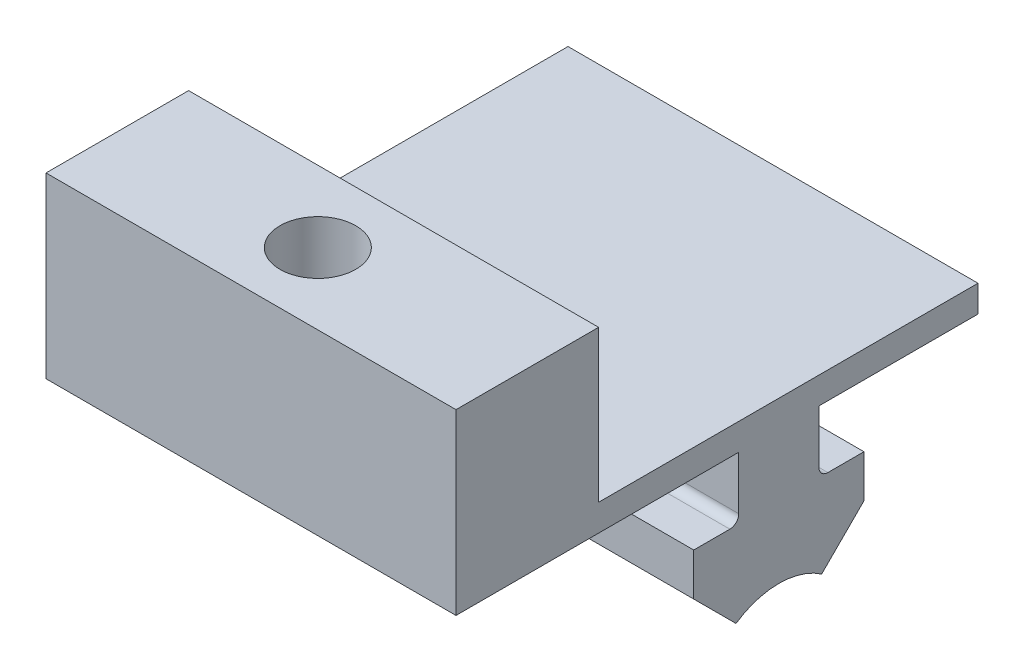
ISO-10303-21;
HEADER;
FILE_DESCRIPTION(('STEP AP214'),'2;1');
FILE_NAME('part.step','',(''),(''),'','','');
FILE_SCHEMA(('AUTOMOTIVE_DESIGN { 1 0 10303 214 1 1 1 1 }'));
ENDSEC;
DATA;
#1=APPLICATION_CONTEXT('core data for automotive mechanical design processes');
#2=APPLICATION_PROTOCOL_DEFINITION('international standard','automotive_design',2000,#1);
#3=PRODUCT_CONTEXT('',#1,'mechanical');
#4=PRODUCT('Part','Part','',(#3));
#5=PRODUCT_RELATED_PRODUCT_CATEGORY('part','',(#4));
#6=PRODUCT_DEFINITION_FORMATION('','',#4);
#7=PRODUCT_DEFINITION_CONTEXT('part definition',#1,'design');
#8=PRODUCT_DEFINITION('design','',#6,#7);
#9=PRODUCT_DEFINITION_SHAPE('','',#8);
#10=(LENGTH_UNIT() NAMED_UNIT(*) SI_UNIT(.MILLI.,.METRE.));
#11=(NAMED_UNIT(*) PLANE_ANGLE_UNIT() SI_UNIT($,.RADIAN.));
#12=(NAMED_UNIT(*) SI_UNIT($,.STERADIAN.) SOLID_ANGLE_UNIT());
#13=UNCERTAINTY_MEASURE_WITH_UNIT(LENGTH_MEASURE(1.E-05),#10,'distance_accuracy_value','');
#14=(GEOMETRIC_REPRESENTATION_CONTEXT(3) GLOBAL_UNCERTAINTY_ASSIGNED_CONTEXT((#13)) GLOBAL_UNIT_ASSIGNED_CONTEXT((#10,
#11,#12)) REPRESENTATION_CONTEXT('',''));
#15=CARTESIAN_POINT('',(0.,0.,0.));
#16=DIRECTION('',(0.,0.,1.));
#17=DIRECTION('',(1.,0.,0.));
#18=AXIS2_PLACEMENT_3D('',#15,#16,#17);
#19=CARTESIAN_POINT('',(586.099999999999,-586.100000000001,-246.077000521135));
#20=DIRECTION('',(0.,0.,1.));
#21=DIRECTION('',(1.,0.,0.));
#22=AXIS2_PLACEMENT_3D('',#19,#20,#21);
#23=PLANE('',#22);
#24=DIRECTION('',(0.,-1.,0.));
#25=VECTOR('',#24,1.);
#26=CARTESIAN_POINT('',(632.099999999999,-586.100000000001,-246.077000521135));
#27=LINE('',#26,#25);
#28=CARTESIAN_POINT('',(632.099999999999,-566.100000000001,-246.077000521135));
#29=VERTEX_POINT('',#28);
#30=CARTESIAN_POINT('',(632.099999999999,-586.100000000001,-246.077000521135));
#31=VERTEX_POINT('',#30);
#32=EDGE_CURVE('E193',#29,#31,#27,.T.);
#33=ORIENTED_EDGE('',*,*,#32,.F.);
#34=DIRECTION('',(1.,0.,0.));
#35=VECTOR('',#34,1.);
#36=CARTESIAN_POINT('',(586.099999999999,-566.100000000001,-246.077000521135));
#37=LINE('',#36,#35);
#38=CARTESIAN_POINT('',(586.099999999999,-566.100000000001,-246.077000521135));
#39=VERTEX_POINT('',#38);
#40=EDGE_CURVE('E11',#39,#29,#37,.T.);
#41=ORIENTED_EDGE('',*,*,#40,.F.);
#42=DIRECTION('',(0.,-1.,0.));
#43=VECTOR('',#42,1.);
#44=CARTESIAN_POINT('',(586.099999999999,-586.100000000001,-246.077000521135));
#45=LINE('',#44,#43);
#46=CARTESIAN_POINT('',(586.099999999999,-586.100000000001,-246.077000521135));
#47=VERTEX_POINT('',#46);
#48=EDGE_CURVE('E244',#39,#47,#45,.T.);
#49=ORIENTED_EDGE('',*,*,#48,.T.);
#50=DIRECTION('',(1.,0.,0.));
#51=VECTOR('',#50,1.);
#52=CARTESIAN_POINT('',(586.099999999999,-586.100000000001,-246.077000521135));
#53=LINE('',#52,#51);
#54=EDGE_CURVE('E39',#47,#31,#53,.T.);
#55=ORIENTED_EDGE('',*,*,#54,.T.);
#56=EDGE_LOOP('',(#33,#41,#49,#55));
#57=FACE_BOUND('',#56,.T.);
#58=ADVANCED_FACE('F36',(#57),#23,.T.);
#59=CARTESIAN_POINT('',(586.099999999999,-566.100000000001,-246.077000521135));
#60=DIRECTION('',(0.,1.,0.));
#61=DIRECTION('',(-1.,0.,0.));
#62=AXIS2_PLACEMENT_3D('',#59,#60,#61);
#63=PLANE('',#62);
#64=CARTESIAN_POINT('',(608.598456538136,-566.100000000001,-254.077000521131));
#65=DIRECTION('',(0.,1.,0.));
#66=DIRECTION('',(-1.,0.,0.));
#67=AXIS2_PLACEMENT_3D('',#64,#65,#66);
#68=CIRCLE('',#67,4.25000000000001);
#69=CARTESIAN_POINT('',(604.348456538136,-566.100000000001,-254.077000521131));
#70=VERTEX_POINT('',#69);
#71=EDGE_CURVE('E362',#70,#70,#68,.T.);
#72=ORIENTED_EDGE('',*,*,#71,.F.);
#73=EDGE_LOOP('',(#72));
#74=FACE_BOUND('',#73,.T.);
#75=DIRECTION('',(0.,0.,1.));
#76=VECTOR('',#75,1.);
#77=CARTESIAN_POINT('',(632.099999999999,-566.100000000001,-246.077000521135));
#78=LINE('',#77,#76);
#79=CARTESIAN_POINT('',(632.099999999999,-566.100000000001,-262.077000521136));
#80=VERTEX_POINT('',#79);
#81=EDGE_CURVE('E242',#80,#29,#78,.T.);
#82=ORIENTED_EDGE('',*,*,#81,.F.);
#83=DIRECTION('',(1.,0.,0.));
#84=VECTOR('',#83,1.);
#85=CARTESIAN_POINT('',(586.099999999999,-566.100000000001,-262.077000521136));
#86=LINE('',#85,#84);
#87=CARTESIAN_POINT('',(586.099999999999,-566.100000000001,-262.077000521136));
#88=VERTEX_POINT('',#87);
#89=EDGE_CURVE('E45',#88,#80,#86,.T.);
#90=ORIENTED_EDGE('',*,*,#89,.F.);
#91=DIRECTION('',(0.,0.,1.));
#92=VECTOR('',#91,1.);
#93=CARTESIAN_POINT('',(586.099999999999,-566.100000000001,-246.077000521135));
#94=LINE('',#93,#92);
#95=EDGE_CURVE('E183',#88,#39,#94,.T.);
#96=ORIENTED_EDGE('',*,*,#95,.T.);
#97=ORIENTED_EDGE('',*,*,#40,.T.);
#98=EDGE_LOOP('',(#82,#90,#96,#97));
#99=FACE_BOUND('',#98,.T.);
#100=ADVANCED_FACE('F277',(#74,#99),#63,.T.);
#101=CARTESIAN_POINT('',(586.099999999999,-566.100000000001,-262.077000521136));
#102=DIRECTION('',(0.,0.,-1.));
#103=DIRECTION('',(0.,1.,0.));
#104=AXIS2_PLACEMENT_3D('',#101,#102,#103);
#105=PLANE('',#104);
#106=DIRECTION('',(0.,1.,0.));
#107=VECTOR('',#106,1.);
#108=CARTESIAN_POINT('',(632.099999999999,-566.100000000001,-262.077000521136));
#109=LINE('',#108,#107);
#110=CARTESIAN_POINT('',(632.099999999999,-583.100000000001,-262.077000521136));
#111=VERTEX_POINT('',#110);
#112=EDGE_CURVE('E170',#111,#80,#109,.T.);
#113=ORIENTED_EDGE('',*,*,#112,.F.);
#114=DIRECTION('',(1.,0.,0.));
#115=VECTOR('',#114,1.);
#116=CARTESIAN_POINT('',(586.099999999999,-583.100000000001,-262.077000521136));
#117=LINE('',#116,#115);
#118=CARTESIAN_POINT('',(586.099999999999,-583.100000000001,-262.077000521136));
#119=VERTEX_POINT('',#118);
#120=EDGE_CURVE('E165',#119,#111,#117,.T.);
#121=ORIENTED_EDGE('',*,*,#120,.F.);
#122=DIRECTION('',(0.,1.,0.));
#123=VECTOR('',#122,1.);
#124=CARTESIAN_POINT('',(586.099999999999,-566.100000000001,-262.077000521136));
#125=LINE('',#124,#123);
#126=EDGE_CURVE('E168',#119,#88,#125,.T.);
#127=ORIENTED_EDGE('',*,*,#126,.T.);
#128=ORIENTED_EDGE('',*,*,#89,.T.);
#129=EDGE_LOOP('',(#113,#121,#127,#128));
#130=FACE_BOUND('',#129,.T.);
#131=ADVANCED_FACE('F167',(#130),#105,.T.);
#132=CARTESIAN_POINT('',(586.099999999999,-583.100000000001,-262.077000521136));
#133=DIRECTION('',(0.,1.,0.));
#134=DIRECTION('',(0.,0.,1.));
#135=AXIS2_PLACEMENT_3D('',#132,#133,#134);
#136=PLANE('',#135);
#137=DIRECTION('',(0.,0.,1.));
#138=VECTOR('',#137,1.);
#139=CARTESIAN_POINT('',(632.099999999999,-583.100000000001,-262.077000521136));
#140=LINE('',#139,#138);
#141=CARTESIAN_POINT('',(632.099999999999,-583.100000000001,-304.643123208106));
#142=VERTEX_POINT('',#141);
#143=EDGE_CURVE('E239',#142,#111,#140,.T.);
#144=ORIENTED_EDGE('',*,*,#143,.F.);
#145=DIRECTION('',(1.,0.,0.));
#146=VECTOR('',#145,1.);
#147=CARTESIAN_POINT('',(586.099999999999,-583.100000000001,-304.643123208106));
#148=LINE('',#147,#146);
#149=CARTESIAN_POINT('',(586.099999999999,-583.100000000001,-304.643123208106));
#150=VERTEX_POINT('',#149);
#151=EDGE_CURVE('E175',#150,#142,#148,.T.);
#152=ORIENTED_EDGE('',*,*,#151,.F.);
#153=DIRECTION('',(0.,0.,1.));
#154=VECTOR('',#153,1.);
#155=CARTESIAN_POINT('',(586.099999999999,-583.100000000001,-262.077000521136));
#156=LINE('',#155,#154);
#157=EDGE_CURVE('E181',#150,#119,#156,.T.);
#158=ORIENTED_EDGE('',*,*,#157,.T.);
#159=ORIENTED_EDGE('',*,*,#120,.T.);
#160=EDGE_LOOP('',(#144,#152,#158,#159));
#161=FACE_BOUND('',#160,.T.);
#162=ADVANCED_FACE('F185',(#161),#136,.T.);
#163=CARTESIAN_POINT('',(586.099999999999,-583.100000000001,-304.643123208106));
#164=DIRECTION('',(0.,0.,-1.));
#165=DIRECTION('',(-1.,0.,0.));
#166=AXIS2_PLACEMENT_3D('',#163,#164,#165);
#167=PLANE('',#166);
#168=DIRECTION('',(0.,1.,0.));
#169=VECTOR('',#168,1.);
#170=CARTESIAN_POINT('',(632.099999999999,-583.100000000001,-304.643123208106));
#171=LINE('',#170,#169);
#172=CARTESIAN_POINT('',(632.099999999999,-586.100000000001,-304.643123208106));
#173=VERTEX_POINT('',#172);
#174=EDGE_CURVE('E236',#173,#142,#171,.T.);
#175=ORIENTED_EDGE('',*,*,#174,.F.);
#176=DIRECTION('',(1.,0.,0.));
#177=VECTOR('',#176,1.);
#178=CARTESIAN_POINT('',(586.099999999999,-586.100000000001,-304.643123208106));
#179=LINE('',#178,#177);
#180=CARTESIAN_POINT('',(586.099999999999,-586.100000000001,-304.643123208106));
#181=VERTEX_POINT('',#180);
#182=EDGE_CURVE('E248',#181,#173,#179,.T.);
#183=ORIENTED_EDGE('',*,*,#182,.F.);
#184=DIRECTION('',(0.,1.,0.));
#185=VECTOR('',#184,1.);
#186=CARTESIAN_POINT('',(586.099999999999,-583.100000000001,-304.643123208106));
#187=LINE('',#186,#185);
#188=EDGE_CURVE('E186',#181,#150,#187,.T.);
#189=ORIENTED_EDGE('',*,*,#188,.T.);
#190=ORIENTED_EDGE('',*,*,#151,.T.);
#191=EDGE_LOOP('',(#175,#183,#189,#190));
#192=FACE_BOUND('',#191,.T.);
#193=ADVANCED_FACE('F292',(#192),#167,.T.);
#194=CARTESIAN_POINT('',(586.099999999999,-586.100000000001,-304.643123208106));
#195=DIRECTION('',(0.,-1.,0.));
#196=DIRECTION('',(0.,0.,-1.));
#197=AXIS2_PLACEMENT_3D('',#194,#195,#196);
#198=PLANE('',#197);
#199=DIRECTION('',(0.,0.,-1.));
#200=VECTOR('',#199,1.);
#201=CARTESIAN_POINT('',(632.099999999999,-586.100000000001,-304.643123208106));
#202=LINE('',#201,#200);
#203=CARTESIAN_POINT('',(632.099999999999,-586.100000000001,-286.8));
#204=VERTEX_POINT('',#203);
#205=EDGE_CURVE('E233',#204,#173,#202,.T.);
#206=ORIENTED_EDGE('',*,*,#205,.F.);
#207=DIRECTION('',(1.,0.,0.));
#208=VECTOR('',#207,1.);
#209=CARTESIAN_POINT('',(586.099999999999,-586.100000000001,-286.8));
#210=LINE('',#209,#208);
#211=CARTESIAN_POINT('',(586.099999999999,-586.100000000001,-286.8));
#212=VERTEX_POINT('',#211);
#213=EDGE_CURVE('E250',#212,#204,#210,.T.);
#214=ORIENTED_EDGE('',*,*,#213,.F.);
#215=DIRECTION('',(0.,0.,-1.));
#216=VECTOR('',#215,1.);
#217=CARTESIAN_POINT('',(586.099999999999,-586.100000000001,-304.643123208106));
#218=LINE('',#217,#216);
#219=EDGE_CURVE('E188',#212,#181,#218,.T.);
#220=ORIENTED_EDGE('',*,*,#219,.T.);
#221=ORIENTED_EDGE('',*,*,#182,.T.);
#222=EDGE_LOOP('',(#206,#214,#220,#221));
#223=FACE_BOUND('',#222,.T.);
#224=ADVANCED_FACE('F295',(#223),#198,.T.);
#225=CARTESIAN_POINT('',(586.099999999999,-586.100000000001,-286.8));
#226=DIRECTION('',(0.,0.,-1.));
#227=DIRECTION('',(0.,1.,0.));
#228=AXIS2_PLACEMENT_3D('',#225,#226,#227);
#229=PLANE('',#228);
#230=DIRECTION('',(0.,1.,0.));
#231=VECTOR('',#230,1.);
#232=CARTESIAN_POINT('',(632.099999999999,-586.100000000001,-286.8));
#233=LINE('',#232,#231);
#234=CARTESIAN_POINT('',(632.099999999999,-592.075000000001,-286.8));
#235=VERTEX_POINT('',#234);
#236=EDGE_CURVE('E230',#235,#204,#233,.T.);
#237=ORIENTED_EDGE('',*,*,#236,.F.);
#238=DIRECTION('',(1.,0.,0.));
#239=VECTOR('',#238,1.);
#240=CARTESIAN_POINT('',(586.099999999999,-592.075000000001,-286.8));
#241=LINE('',#240,#239);
#242=CARTESIAN_POINT('',(586.099999999999,-592.075000000001,-286.8));
#243=VERTEX_POINT('',#242);
#244=EDGE_CURVE('E252',#243,#235,#241,.T.);
#245=ORIENTED_EDGE('',*,*,#244,.F.);
#246=DIRECTION('',(0.,1.,0.));
#247=VECTOR('',#246,1.);
#248=CARTESIAN_POINT('',(586.099999999999,-592.075000000001,-286.8));
#249=LINE('',#248,#247);
#250=EDGE_CURVE('E399',#243,#212,#249,.T.);
#251=ORIENTED_EDGE('',*,*,#250,.T.);
#252=ORIENTED_EDGE('',*,*,#213,.T.);
#253=EDGE_LOOP('',(#237,#245,#251,#252));
#254=FACE_BOUND('',#253,.T.);
#255=ADVANCED_FACE('F299',(#254),#229,.T.);
#256=CARTESIAN_POINT('',(586.099999999999,-592.075000000001,-287.8));
#257=DIRECTION('',(1.,0.,0.));
#258=DIRECTION('',(0.,0.,-1.));
#259=AXIS2_PLACEMENT_3D('',#256,#257,#258);
#260=CYLINDRICAL_SURFACE('',#259,1.);
#261=CARTESIAN_POINT('',(632.099999999999,-592.075000000001,-287.8));
#262=DIRECTION('',(-1.,0.,0.));
#263=DIRECTION('',(0.,0.,-1.));
#264=AXIS2_PLACEMENT_3D('',#261,#262,#263);
#265=CIRCLE('',#264,1.);
#266=CARTESIAN_POINT('',(632.099999999999,-593.075000000001,-287.8));
#267=VERTEX_POINT('',#266);
#268=EDGE_CURVE('E227',#267,#235,#265,.T.);
#269=ORIENTED_EDGE('',*,*,#268,.F.);
#270=DIRECTION('',(1.,0.,0.));
#271=VECTOR('',#270,1.);
#272=CARTESIAN_POINT('',(586.099999999999,-593.075000000001,-287.8));
#273=LINE('',#272,#271);
#274=CARTESIAN_POINT('',(586.099999999999,-593.075000000001,-287.8));
#275=VERTEX_POINT('',#274);
#276=EDGE_CURVE('E255',#275,#267,#273,.T.);
#277=ORIENTED_EDGE('',*,*,#276,.F.);
#278=CARTESIAN_POINT('',(586.099999999999,-592.075000000001,-287.8));
#279=DIRECTION('',(-1.,0.,0.));
#280=DIRECTION('',(0.,0.,-1.));
#281=AXIS2_PLACEMENT_3D('',#278,#279,#280);
#282=CIRCLE('',#281,1.);
#283=EDGE_CURVE('E396',#275,#243,#282,.T.);
#284=ORIENTED_EDGE('',*,*,#283,.T.);
#285=ORIENTED_EDGE('',*,*,#244,.T.);
#286=EDGE_LOOP('',(#269,#277,#284,#285));
#287=FACE_BOUND('',#286,.T.);
#288=ADVANCED_FACE('F303',(#287),#260,.F.);
#289=CARTESIAN_POINT('',(586.099999999999,-593.075000000001,-291.85));
#290=DIRECTION('',(0.,1.,0.));
#291=DIRECTION('',(-1.,0.,0.));
#292=AXIS2_PLACEMENT_3D('',#289,#290,#291);
#293=PLANE('',#292);
#294=DIRECTION('',(0.,0.,1.));
#295=VECTOR('',#294,1.);
#296=CARTESIAN_POINT('',(632.099999999999,-593.075000000001,-291.85));
#297=LINE('',#296,#295);
#298=CARTESIAN_POINT('',(632.099999999999,-593.075000000001,-291.85));
#299=VERTEX_POINT('',#298);
#300=EDGE_CURVE('E224',#299,#267,#297,.T.);
#301=ORIENTED_EDGE('',*,*,#300,.F.);
#302=DIRECTION('',(1.,0.,0.));
#303=VECTOR('',#302,1.);
#304=CARTESIAN_POINT('',(586.099999999999,-593.075000000001,-291.85));
#305=LINE('',#304,#303);
#306=CARTESIAN_POINT('',(586.099999999999,-593.075000000001,-291.85));
#307=VERTEX_POINT('',#306);
#308=EDGE_CURVE('E257',#307,#299,#305,.T.);
#309=ORIENTED_EDGE('',*,*,#308,.F.);
#310=DIRECTION('',(0.,0.,1.));
#311=VECTOR('',#310,1.);
#312=CARTESIAN_POINT('',(586.099999999999,-593.075000000001,-291.85));
#313=LINE('',#312,#311);
#314=EDGE_CURVE('E393',#307,#275,#313,.T.);
#315=ORIENTED_EDGE('',*,*,#314,.T.);
#316=ORIENTED_EDGE('',*,*,#276,.T.);
#317=EDGE_LOOP('',(#301,#309,#315,#316));
#318=FACE_BOUND('',#317,.T.);
#319=ADVANCED_FACE('F307',(#318),#293,.T.);
#320=CARTESIAN_POINT('',(586.099999999999,-597.842893218814,-291.85));
#321=DIRECTION('',(0.,0.,-1.));
#322=DIRECTION('',(-1.,0.,0.));
#323=AXIS2_PLACEMENT_3D('',#320,#321,#322);
#324=PLANE('',#323);
#325=DIRECTION('',(0.,1.,0.));
#326=VECTOR('',#325,1.);
#327=CARTESIAN_POINT('',(632.099999999999,-597.842893218814,-291.85));
#328=LINE('',#327,#326);
#329=CARTESIAN_POINT('',(632.099999999999,-597.842893218814,-291.85));
#330=VERTEX_POINT('',#329);
#331=EDGE_CURVE('E221',#330,#299,#328,.T.);
#332=ORIENTED_EDGE('',*,*,#331,.F.);
#333=DIRECTION('',(1.,0.,0.));
#334=VECTOR('',#333,1.);
#335=CARTESIAN_POINT('',(586.099999999999,-597.842893218814,-291.85));
#336=LINE('',#335,#334);
#337=CARTESIAN_POINT('',(586.099999999999,-597.842893218814,-291.85));
#338=VERTEX_POINT('',#337);
#339=EDGE_CURVE('E259',#338,#330,#336,.T.);
#340=ORIENTED_EDGE('',*,*,#339,.F.);
#341=DIRECTION('',(0.,1.,0.));
#342=VECTOR('',#341,1.);
#343=CARTESIAN_POINT('',(586.099999999999,-597.842893218814,-291.85));
#344=LINE('',#343,#342);
#345=EDGE_CURVE('E390',#338,#307,#344,.T.);
#346=ORIENTED_EDGE('',*,*,#345,.T.);
#347=ORIENTED_EDGE('',*,*,#308,.T.);
#348=EDGE_LOOP('',(#332,#340,#346,#347));
#349=FACE_BOUND('',#348,.T.);
#350=ADVANCED_FACE('F311',(#349),#324,.T.);
#351=CARTESIAN_POINT('',(586.099999999999,-602.588217609605,-287.104675609209));
#352=DIRECTION('',(0.,-0.707106781186552,-0.707106781186543));
#353=DIRECTION('',(0.,0.707106781186543,-0.707106781186552));
#354=AXIS2_PLACEMENT_3D('',#351,#352,#353);
#355=PLANE('',#354);
#356=DIRECTION('',(0.,0.707106781186543,-0.707106781186552));
#357=VECTOR('',#356,1.);
#358=CARTESIAN_POINT('',(632.099999999999,-602.588217609605,-287.104675609209));
#359=LINE('',#358,#357);
#360=CARTESIAN_POINT('',(632.099999999999,-602.588217609605,-287.104675609209));
#361=VERTEX_POINT('',#360);
#362=EDGE_CURVE('E218',#361,#330,#359,.T.);
#363=ORIENTED_EDGE('',*,*,#362,.F.);
#364=DIRECTION('',(1.,0.,0.));
#365=VECTOR('',#364,1.);
#366=CARTESIAN_POINT('',(586.099999999999,-602.588217609605,-287.104675609209));
#367=LINE('',#366,#365);
#368=CARTESIAN_POINT('',(586.099999999999,-602.588217609605,-287.104675609209));
#369=VERTEX_POINT('',#368);
#370=EDGE_CURVE('E261',#369,#361,#367,.T.);
#371=ORIENTED_EDGE('',*,*,#370,.F.);
#372=DIRECTION('',(0.,0.707106781186543,-0.707106781186552));
#373=VECTOR('',#372,1.);
#374=CARTESIAN_POINT('',(586.099999999999,-602.588217609605,-287.104675609209));
#375=LINE('',#374,#373);
#376=EDGE_CURVE('E387',#369,#338,#375,.T.);
#377=ORIENTED_EDGE('',*,*,#376,.T.);
#378=ORIENTED_EDGE('',*,*,#339,.T.);
#379=EDGE_LOOP('',(#363,#371,#377,#378));
#380=FACE_BOUND('',#379,.T.);
#381=ADVANCED_FACE('F315',(#380),#355,.T.);
#382=CARTESIAN_POINT('',(586.099999999999,-609.600000000001,-282.3));
#383=DIRECTION('',(1.,0.,0.));
#384=DIRECTION('',(0.,0.,-1.));
#385=AXIS2_PLACEMENT_3D('',#382,#383,#384);
#386=CYLINDRICAL_SURFACE('',#385,8.50000000000006);
#387=CARTESIAN_POINT('',(632.099999999999,-609.600000000001,-282.3));
#388=DIRECTION('',(-1.,0.,0.));
#389=DIRECTION('',(0.,0.,-1.));
#390=AXIS2_PLACEMENT_3D('',#387,#388,#389);
#391=CIRCLE('',#390,8.50000000000006);
#392=CARTESIAN_POINT('',(632.099999999999,-602.588217609605,-277.49532439079));
#393=VERTEX_POINT('',#392);
#394=EDGE_CURVE('E215',#393,#361,#391,.T.);
#395=ORIENTED_EDGE('',*,*,#394,.F.);
#396=DIRECTION('',(1.,0.,0.));
#397=VECTOR('',#396,1.);
#398=CARTESIAN_POINT('',(586.099999999999,-602.588217609605,-277.49532439079));
#399=LINE('',#398,#397);
#400=CARTESIAN_POINT('',(586.099999999999,-602.588217609605,-277.49532439079));
#401=VERTEX_POINT('',#400);
#402=EDGE_CURVE('E263',#401,#393,#399,.T.);
#403=ORIENTED_EDGE('',*,*,#402,.F.);
#404=CARTESIAN_POINT('',(586.099999999999,-609.600000000001,-282.3));
#405=DIRECTION('',(-1.,0.,0.));
#406=DIRECTION('',(0.,0.,-1.));
#407=AXIS2_PLACEMENT_3D('',#404,#405,#406);
#408=CIRCLE('',#407,8.50000000000006);
#409=EDGE_CURVE('E384',#401,#369,#408,.T.);
#410=ORIENTED_EDGE('',*,*,#409,.T.);
#411=ORIENTED_EDGE('',*,*,#370,.T.);
#412=EDGE_LOOP('',(#395,#403,#410,#411));
#413=FACE_BOUND('',#412,.T.);
#414=ADVANCED_FACE('F319',(#413),#386,.F.);
#415=CARTESIAN_POINT('',(586.099999999999,-597.842893218814,-272.75));
#416=DIRECTION('',(0.,-0.707106781186539,0.707106781186556));
#417=DIRECTION('',(0.,-0.707106781186556,-0.707106781186539));
#418=AXIS2_PLACEMENT_3D('',#415,#416,#417);
#419=PLANE('',#418);
#420=DIRECTION('',(0.,-0.707106781186556,-0.707106781186539));
#421=VECTOR('',#420,1.);
#422=CARTESIAN_POINT('',(632.099999999999,-597.842893218814,-272.75));
#423=LINE('',#422,#421);
#424=CARTESIAN_POINT('',(632.099999999999,-597.842893218814,-272.75));
#425=VERTEX_POINT('',#424);
#426=EDGE_CURVE('E212',#425,#393,#423,.T.);
#427=ORIENTED_EDGE('',*,*,#426,.F.);
#428=DIRECTION('',(1.,0.,0.));
#429=VECTOR('',#428,1.);
#430=CARTESIAN_POINT('',(586.099999999999,-597.842893218814,-272.75));
#431=LINE('',#430,#429);
#432=CARTESIAN_POINT('',(586.099999999999,-597.842893218814,-272.75));
#433=VERTEX_POINT('',#432);
#434=EDGE_CURVE('E265',#433,#425,#431,.T.);
#435=ORIENTED_EDGE('',*,*,#434,.F.);
#436=DIRECTION('',(0.,-0.707106781186556,-0.707106781186539));
#437=VECTOR('',#436,1.);
#438=CARTESIAN_POINT('',(586.099999999999,-597.842893218814,-272.75));
#439=LINE('',#438,#437);
#440=EDGE_CURVE('E381',#433,#401,#439,.T.);
#441=ORIENTED_EDGE('',*,*,#440,.T.);
#442=ORIENTED_EDGE('',*,*,#402,.T.);
#443=EDGE_LOOP('',(#427,#435,#441,#442));
#444=FACE_BOUND('',#443,.T.);
#445=ADVANCED_FACE('F323',(#444),#419,.T.);
#446=CARTESIAN_POINT('',(586.099999999999,-593.075000000001,-272.75));
#447=DIRECTION('',(0.,0.,1.));
#448=DIRECTION('',(0.,-1.,0.));
#449=AXIS2_PLACEMENT_3D('',#446,#447,#448);
#450=PLANE('',#449);
#451=DIRECTION('',(0.,-1.,0.));
#452=VECTOR('',#451,1.);
#453=CARTESIAN_POINT('',(632.099999999999,-593.075000000001,-272.75));
#454=LINE('',#453,#452);
#455=CARTESIAN_POINT('',(632.099999999999,-593.075000000001,-272.75));
#456=VERTEX_POINT('',#455);
#457=EDGE_CURVE('E209',#456,#425,#454,.T.);
#458=ORIENTED_EDGE('',*,*,#457,.F.);
#459=DIRECTION('',(1.,0.,0.));
#460=VECTOR('',#459,1.);
#461=CARTESIAN_POINT('',(586.099999999999,-593.075000000001,-272.75));
#462=LINE('',#461,#460);
#463=CARTESIAN_POINT('',(586.099999999999,-593.075000000001,-272.75));
#464=VERTEX_POINT('',#463);
#465=EDGE_CURVE('E267',#464,#456,#462,.T.);
#466=ORIENTED_EDGE('',*,*,#465,.F.);
#467=DIRECTION('',(0.,-1.,0.));
#468=VECTOR('',#467,1.);
#469=CARTESIAN_POINT('',(586.099999999999,-593.075000000001,-272.75));
#470=LINE('',#469,#468);
#471=EDGE_CURVE('E378',#464,#433,#470,.T.);
#472=ORIENTED_EDGE('',*,*,#471,.T.);
#473=ORIENTED_EDGE('',*,*,#434,.T.);
#474=EDGE_LOOP('',(#458,#466,#472,#473));
#475=FACE_BOUND('',#474,.T.);
#476=ADVANCED_FACE('F327',(#475),#450,.T.);
#477=CARTESIAN_POINT('',(586.099999999999,-593.075000000001,-276.8));
#478=DIRECTION('',(0.,1.,0.));
#479=DIRECTION('',(-1.,0.,0.));
#480=AXIS2_PLACEMENT_3D('',#477,#478,#479);
#481=PLANE('',#480);
#482=DIRECTION('',(0.,0.,1.));
#483=VECTOR('',#482,1.);
#484=CARTESIAN_POINT('',(632.099999999999,-593.075000000001,-276.8));
#485=LINE('',#484,#483);
#486=CARTESIAN_POINT('',(632.099999999999,-593.075000000001,-276.8));
#487=VERTEX_POINT('',#486);
#488=EDGE_CURVE('E206',#487,#456,#485,.T.);
#489=ORIENTED_EDGE('',*,*,#488,.F.);
#490=DIRECTION('',(1.,0.,0.));
#491=VECTOR('',#490,1.);
#492=CARTESIAN_POINT('',(586.099999999999,-593.075000000001,-276.8));
#493=LINE('',#492,#491);
#494=CARTESIAN_POINT('',(586.099999999999,-593.075000000001,-276.8));
#495=VERTEX_POINT('',#494);
#496=EDGE_CURVE('E269',#495,#487,#493,.T.);
#497=ORIENTED_EDGE('',*,*,#496,.F.);
#498=DIRECTION('',(0.,0.,1.));
#499=VECTOR('',#498,1.);
#500=CARTESIAN_POINT('',(586.099999999999,-593.075000000001,-276.8));
#501=LINE('',#500,#499);
#502=EDGE_CURVE('E375',#495,#464,#501,.T.);
#503=ORIENTED_EDGE('',*,*,#502,.T.);
#504=ORIENTED_EDGE('',*,*,#465,.T.);
#505=EDGE_LOOP('',(#489,#497,#503,#504));
#506=FACE_BOUND('',#505,.T.);
#507=ADVANCED_FACE('F331',(#506),#481,.T.);
#508=CARTESIAN_POINT('',(586.099999999999,-592.075000000001,-276.8));
#509=DIRECTION('',(1.,0.,0.));
#510=DIRECTION('',(0.,0.,-1.));
#511=AXIS2_PLACEMENT_3D('',#508,#509,#510);
#512=CYLINDRICAL_SURFACE('',#511,0.999999999999918);
#513=CARTESIAN_POINT('',(632.099999999999,-592.075000000001,-276.8));
#514=DIRECTION('',(-1.,0.,0.));
#515=DIRECTION('',(0.,0.,-1.));
#516=AXIS2_PLACEMENT_3D('',#513,#514,#515);
#517=CIRCLE('',#516,0.999999999999918);
#518=CARTESIAN_POINT('',(632.099999999999,-592.075000000001,-277.8));
#519=VERTEX_POINT('',#518);
#520=EDGE_CURVE('E203',#519,#487,#517,.T.);
#521=ORIENTED_EDGE('',*,*,#520,.F.);
#522=DIRECTION('',(1.,0.,0.));
#523=VECTOR('',#522,1.);
#524=CARTESIAN_POINT('',(586.099999999999,-592.075000000001,-277.8));
#525=LINE('',#524,#523);
#526=CARTESIAN_POINT('',(586.099999999999,-592.075000000001,-277.8));
#527=VERTEX_POINT('',#526);
#528=EDGE_CURVE('E271',#527,#519,#525,.T.);
#529=ORIENTED_EDGE('',*,*,#528,.F.);
#530=CARTESIAN_POINT('',(586.099999999999,-592.075000000001,-276.8));
#531=DIRECTION('',(-1.,0.,0.));
#532=DIRECTION('',(0.,0.,-1.));
#533=AXIS2_PLACEMENT_3D('',#530,#531,#532);
#534=CIRCLE('',#533,0.999999999999918);
#535=EDGE_CURVE('E372',#527,#495,#534,.T.);
#536=ORIENTED_EDGE('',*,*,#535,.T.);
#537=ORIENTED_EDGE('',*,*,#496,.T.);
#538=EDGE_LOOP('',(#521,#529,#536,#537));
#539=FACE_BOUND('',#538,.T.);
#540=ADVANCED_FACE('F335',(#539),#512,.F.);
#541=CARTESIAN_POINT('',(586.099999999999,-589.100000000001,-277.8));
#542=DIRECTION('',(0.,0.,1.));
#543=DIRECTION('',(0.,-1.,0.));
#544=AXIS2_PLACEMENT_3D('',#541,#542,#543);
#545=PLANE('',#544);
#546=DIRECTION('',(0.,-1.,0.));
#547=VECTOR('',#546,1.);
#548=CARTESIAN_POINT('',(632.099999999999,-589.100000000001,-277.8));
#549=LINE('',#548,#547);
#550=CARTESIAN_POINT('',(632.099999999999,-586.100000000001,-277.8));
#551=VERTEX_POINT('',#550);
#552=EDGE_CURVE('E200',#551,#519,#549,.T.);
#553=ORIENTED_EDGE('',*,*,#552,.F.);
#554=DIRECTION('',(1.,0.,0.));
#555=VECTOR('',#554,1.);
#556=CARTESIAN_POINT('',(586.099999999999,-586.100000000001,-277.8));
#557=LINE('',#556,#555);
#558=CARTESIAN_POINT('',(586.099999999999,-586.100000000001,-277.8));
#559=VERTEX_POINT('',#558);
#560=EDGE_CURVE('E272',#559,#551,#557,.T.);
#561=ORIENTED_EDGE('',*,*,#560,.F.);
#562=DIRECTION('',(0.,-1.,0.));
#563=VECTOR('',#562,1.);
#564=CARTESIAN_POINT('',(586.099999999999,-589.100000000001,-277.8));
#565=LINE('',#564,#563);
#566=EDGE_CURVE('E370',#559,#527,#565,.T.);
#567=ORIENTED_EDGE('',*,*,#566,.T.);
#568=ORIENTED_EDGE('',*,*,#528,.T.);
#569=EDGE_LOOP('',(#553,#561,#567,#568));
#570=FACE_BOUND('',#569,.T.);
#571=ADVANCED_FACE('F339',(#570),#545,.T.);
#572=CARTESIAN_POINT('',(586.099999999999,-586.100000000001,-277.8));
#573=DIRECTION('',(0.,-1.,0.));
#574=DIRECTION('',(1.,0.,0.));
#575=AXIS2_PLACEMENT_3D('',#572,#573,#574);
#576=PLANE('',#575);
#577=DIRECTION('',(0.,0.,-1.));
#578=VECTOR('',#577,1.);
#579=CARTESIAN_POINT('',(632.099999999999,-586.100000000001,-277.8));
#580=LINE('',#579,#578);
#581=EDGE_CURVE('E196',#31,#551,#580,.T.);
#582=ORIENTED_EDGE('',*,*,#581,.F.);
#583=ORIENTED_EDGE('',*,*,#54,.F.);
#584=DIRECTION('',(0.,0.,-1.));
#585=VECTOR('',#584,1.);
#586=CARTESIAN_POINT('',(586.099999999999,-586.100000000001,-277.8));
#587=LINE('',#586,#585);
#588=EDGE_CURVE('E368',#47,#559,#587,.T.);
#589=ORIENTED_EDGE('',*,*,#588,.T.);
#590=ORIENTED_EDGE('',*,*,#560,.T.);
#591=EDGE_LOOP('',(#582,#583,#589,#590));
#592=FACE_BOUND('',#591,.T.);
#593=ADVANCED_FACE('F274',(#592),#576,.T.);
#594=CARTESIAN_POINT('',(586.099999999999,-592.075000000001,-287.8));
#595=DIRECTION('',(1.,0.,0.));
#596=DIRECTION('',(0.,0.,-1.));
#597=AXIS2_PLACEMENT_3D('',#594,#595,#596);
#598=PLANE('',#597);
#599=ORIENTED_EDGE('',*,*,#48,.F.);
#600=ORIENTED_EDGE('',*,*,#95,.F.);
#601=ORIENTED_EDGE('',*,*,#126,.F.);
#602=ORIENTED_EDGE('',*,*,#157,.F.);
#603=ORIENTED_EDGE('',*,*,#188,.F.);
#604=ORIENTED_EDGE('',*,*,#219,.F.);
#605=ORIENTED_EDGE('',*,*,#250,.F.);
#606=ORIENTED_EDGE('',*,*,#283,.F.);
#607=ORIENTED_EDGE('',*,*,#314,.F.);
#608=ORIENTED_EDGE('',*,*,#345,.F.);
#609=ORIENTED_EDGE('',*,*,#376,.F.);
#610=ORIENTED_EDGE('',*,*,#409,.F.);
#611=ORIENTED_EDGE('',*,*,#440,.F.);
#612=ORIENTED_EDGE('',*,*,#471,.F.);
#613=ORIENTED_EDGE('',*,*,#502,.F.);
#614=ORIENTED_EDGE('',*,*,#535,.F.);
#615=ORIENTED_EDGE('',*,*,#566,.F.);
#616=ORIENTED_EDGE('',*,*,#588,.F.);
#617=EDGE_LOOP('',(#599,#600,#601,#602,#603,#604,#605,#606,#607,#608,#609,#610,#611,#612,#613,
#614,#615,#616));
#618=FACE_BOUND('',#617,.T.);
#619=ADVANCED_FACE('F179',(#618),#598,.F.);
#620=CARTESIAN_POINT('',(632.099999999999,-592.075000000001,-287.8));
#621=DIRECTION('',(1.,0.,0.));
#622=DIRECTION('',(0.,0.,-1.));
#623=AXIS2_PLACEMENT_3D('',#620,#621,#622);
#624=PLANE('',#623);
#625=ORIENTED_EDGE('',*,*,#32,.T.);
#626=ORIENTED_EDGE('',*,*,#581,.T.);
#627=ORIENTED_EDGE('',*,*,#552,.T.);
#628=ORIENTED_EDGE('',*,*,#520,.T.);
#629=ORIENTED_EDGE('',*,*,#488,.T.);
#630=ORIENTED_EDGE('',*,*,#457,.T.);
#631=ORIENTED_EDGE('',*,*,#426,.T.);
#632=ORIENTED_EDGE('',*,*,#394,.T.);
#633=ORIENTED_EDGE('',*,*,#362,.T.);
#634=ORIENTED_EDGE('',*,*,#331,.T.);
#635=ORIENTED_EDGE('',*,*,#300,.T.);
#636=ORIENTED_EDGE('',*,*,#268,.T.);
#637=ORIENTED_EDGE('',*,*,#236,.T.);
#638=ORIENTED_EDGE('',*,*,#205,.T.);
#639=ORIENTED_EDGE('',*,*,#174,.T.);
#640=ORIENTED_EDGE('',*,*,#143,.T.);
#641=ORIENTED_EDGE('',*,*,#112,.T.);
#642=ORIENTED_EDGE('',*,*,#81,.T.);
#643=EDGE_LOOP('',(#625,#626,#627,#628,#629,#630,#631,#632,#633,#634,#635,#636,#637,#638,#639,
#640,#641,#642));
#644=FACE_BOUND('',#643,.T.);
#645=ADVANCED_FACE('F276',(#644),#624,.T.);
#646=CARTESIAN_POINT('',(608.598456538136,-576.100000000001,-254.077000521131));
#647=DIRECTION('',(0.,1.,0.));
#648=DIRECTION('',(-1.,0.,0.));
#649=AXIS2_PLACEMENT_3D('',#646,#647,#648);
#650=CYLINDRICAL_SURFACE('',#649,4.25000000000001);
#651=CARTESIAN_POINT('',(608.598456538136,-576.100000000001,-254.077000521131));
#652=DIRECTION('',(0.,1.,0.));
#653=DIRECTION('',(-1.,0.,0.));
#654=AXIS2_PLACEMENT_3D('',#651,#652,#653);
#655=CIRCLE('',#654,4.25000000000001);
#656=CARTESIAN_POINT('',(604.348456538136,-576.100000000001,-254.077000521131));
#657=VERTEX_POINT('',#656);
#658=EDGE_CURVE('E197',#657,#657,#655,.T.);
#659=ORIENTED_EDGE('',*,*,#658,.F.);
#660=EDGE_LOOP('',(#659));
#661=FACE_BOUND('',#660,.T.);
#662=ORIENTED_EDGE('',*,*,#71,.T.);
#663=EDGE_LOOP('',(#662));
#664=FACE_BOUND('',#663,.T.);
#665=ADVANCED_FACE('F350',(#661,#664),#650,.F.);
#666=CARTESIAN_POINT('',(608.598456538136,-576.100000000001,-254.077000521131));
#667=DIRECTION('',(0.,1.,0.));
#668=DIRECTION('',(-1.,0.,0.));
#669=AXIS2_PLACEMENT_3D('',#666,#667,#668);
#670=PLANE('',#669);
#671=ORIENTED_EDGE('',*,*,#658,.T.);
#672=EDGE_LOOP('',(#671));
#673=FACE_BOUND('',#672,.T.);
#674=ADVANCED_FACE('F354',(#673),#670,.T.);
#675=CLOSED_SHELL('',(#58,#100,#131,#162,#193,#224,#255,#288,#319,#350,#381,#414,#445,#476,#507,
#540,#571,#593,#619,#645,#665,#674));
#676=MANIFOLD_SOLID_BREP('B2',#675);
#677=ADVANCED_BREP_SHAPE_REPRESENTATION('',(#18,#676),#14);
#678=SHAPE_DEFINITION_REPRESENTATION(#9,#677);
ENDSEC;
END-ISO-10303-21;
